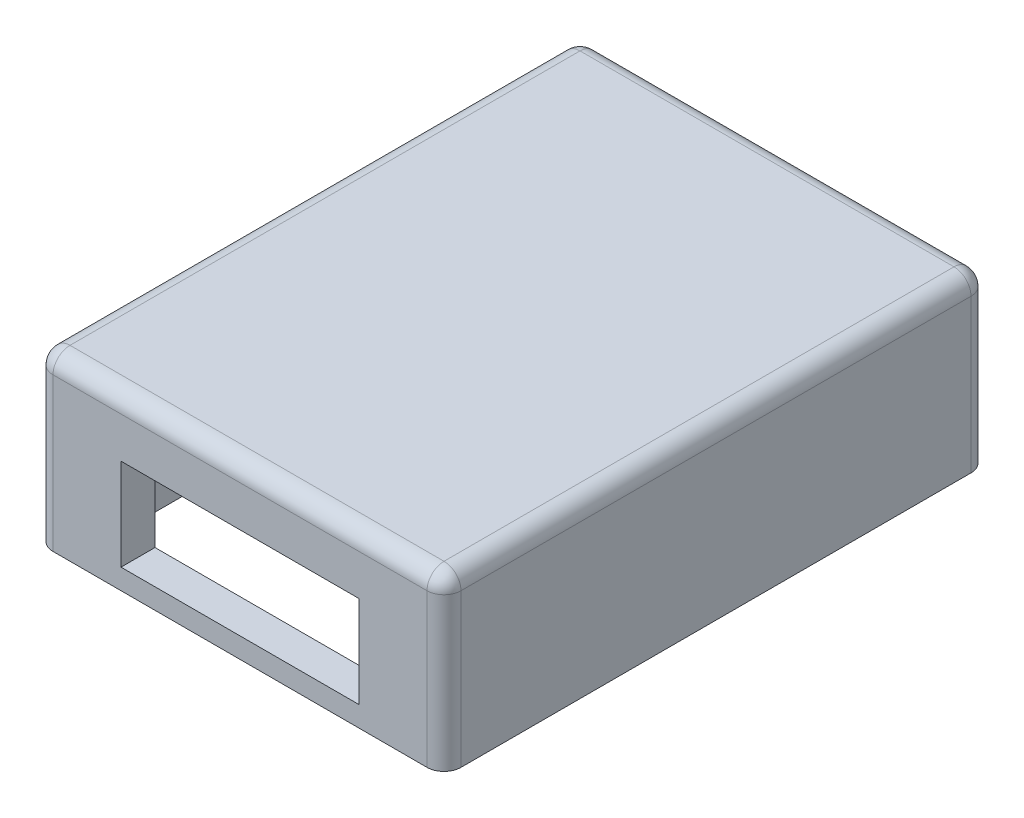
ISO-10303-21;
HEADER;
FILE_DESCRIPTION(('STEP AP214'),'2;1');
FILE_NAME('part.step','',(''),(''),'','','');
FILE_SCHEMA(('AUTOMOTIVE_DESIGN { 1 0 10303 214 1 1 1 1 }'));
ENDSEC;
DATA;
#1=APPLICATION_CONTEXT('core data for automotive mechanical design processes');
#2=APPLICATION_PROTOCOL_DEFINITION('international standard','automotive_design',2000,#1);
#3=PRODUCT_CONTEXT('',#1,'mechanical');
#4=PRODUCT('Part','Part','',(#3));
#5=PRODUCT_RELATED_PRODUCT_CATEGORY('part','',(#4));
#6=PRODUCT_DEFINITION_FORMATION('','',#4);
#7=PRODUCT_DEFINITION_CONTEXT('part definition',#1,'design');
#8=PRODUCT_DEFINITION('design','',#6,#7);
#9=PRODUCT_DEFINITION_SHAPE('','',#8);
#10=(LENGTH_UNIT() NAMED_UNIT(*) SI_UNIT(.MILLI.,.METRE.));
#11=(NAMED_UNIT(*) PLANE_ANGLE_UNIT() SI_UNIT($,.RADIAN.));
#12=(NAMED_UNIT(*) SI_UNIT($,.STERADIAN.) SOLID_ANGLE_UNIT());
#13=UNCERTAINTY_MEASURE_WITH_UNIT(LENGTH_MEASURE(1.E-05),#10,'distance_accuracy_value','');
#14=(GEOMETRIC_REPRESENTATION_CONTEXT(3) GLOBAL_UNCERTAINTY_ASSIGNED_CONTEXT((#13)) GLOBAL_UNIT_ASSIGNED_CONTEXT((#10,
#11,#12)) REPRESENTATION_CONTEXT('',''));
#15=CARTESIAN_POINT('',(0.,0.,0.));
#16=DIRECTION('',(0.,0.,1.));
#17=DIRECTION('',(1.,0.,0.));
#18=AXIS2_PLACEMENT_3D('',#15,#16,#17);
#19=CARTESIAN_POINT('',(0.,0.,160.));
#20=DIRECTION('',(1.,0.,0.));
#21=DIRECTION('',(0.,1.,0.));
#22=AXIS2_PLACEMENT_3D('',#19,#20,#21);
#23=PLANE('',#22);
#24=DIRECTION('',(0.,-1.,0.));
#25=VECTOR('',#24,1.);
#26=CARTESIAN_POINT('',(0.,0.,155.));
#27=LINE('',#26,#25);
#28=CARTESIAN_POINT('',(0.,-50.,155.));
#29=VERTEX_POINT('',#28);
#30=CARTESIAN_POINT('',(0.,-5.,155.));
#31=VERTEX_POINT('',#30);
#32=EDGE_CURVE('E281',#29,#31,#27,.F.);
#33=ORIENTED_EDGE('',*,*,#32,.T.);
#34=DIRECTION('',(0.,0.,-1.));
#35=VECTOR('',#34,1.);
#36=CARTESIAN_POINT('',(0.,-5.,160.));
#37=LINE('',#36,#35);
#38=CARTESIAN_POINT('',(0.,-5.,5.));
#39=VERTEX_POINT('',#38);
#40=EDGE_CURVE('E405',#31,#39,#37,.T.);
#41=ORIENTED_EDGE('',*,*,#40,.T.);
#42=DIRECTION('',(0.,-1.,0.));
#43=VECTOR('',#42,1.);
#44=CARTESIAN_POINT('',(0.,0.,5.));
#45=LINE('',#44,#43);
#46=CARTESIAN_POINT('',(0.,-50.,5.));
#47=VERTEX_POINT('',#46);
#48=EDGE_CURVE('E284',#39,#47,#45,.T.);
#49=ORIENTED_EDGE('',*,*,#48,.T.);
#50=DIRECTION('',(0.,0.,-1.));
#51=VECTOR('',#50,1.);
#52=CARTESIAN_POINT('',(0.,-50.,160.));
#53=LINE('',#52,#51);
#54=EDGE_CURVE('E274',#29,#47,#53,.T.);
#55=ORIENTED_EDGE('',*,*,#54,.F.);
#56=EDGE_LOOP('',(#33,#41,#49,#55));
#57=FACE_BOUND('',#56,.T.);
#58=ADVANCED_FACE('F38',(#57),#23,.F.);
#59=CARTESIAN_POINT('',(0.,-50.,160.));
#60=DIRECTION('',(0.,1.,0.));
#61=DIRECTION('',(0.,0.,1.));
#62=AXIS2_PLACEMENT_3D('',#59,#60,#61);
#63=PLANE('',#62);
#64=CARTESIAN_POINT('',(5.00000000000001,-50.,5.));
#65=DIRECTION('',(0.,-1.,0.));
#66=DIRECTION('',(0.,0.,-1.));
#67=AXIS2_PLACEMENT_3D('',#64,#65,#66);
#68=CIRCLE('',#67,1.5);
#69=CARTESIAN_POINT('',(5.00000000000001,-50.,3.5));
#70=VERTEX_POINT('',#69);
#71=EDGE_CURVE('E225',#70,#70,#68,.T.);
#72=ORIENTED_EDGE('',*,*,#71,.F.);
#73=EDGE_LOOP('',(#72));
#74=FACE_BOUND('',#73,.T.);
#75=CARTESIAN_POINT('',(115.,-50.,5.));
#76=DIRECTION('',(0.,-1.,0.));
#77=DIRECTION('',(0.,0.,-1.));
#78=AXIS2_PLACEMENT_3D('',#75,#76,#77);
#79=CIRCLE('',#78,1.5);
#80=CARTESIAN_POINT('',(115.,-50.,3.50000000000001));
#81=VERTEX_POINT('',#80);
#82=EDGE_CURVE('E238',#81,#81,#79,.T.);
#83=ORIENTED_EDGE('',*,*,#82,.F.);
#84=EDGE_LOOP('',(#83));
#85=FACE_BOUND('',#84,.T.);
#86=CARTESIAN_POINT('',(115.,-50.,155.));
#87=DIRECTION('',(0.,-1.,0.));
#88=DIRECTION('',(0.,0.,-1.));
#89=AXIS2_PLACEMENT_3D('',#86,#87,#88);
#90=CIRCLE('',#89,1.5);
#91=CARTESIAN_POINT('',(115.,-50.,153.5));
#92=VERTEX_POINT('',#91);
#93=EDGE_CURVE('E232',#92,#92,#90,.T.);
#94=ORIENTED_EDGE('',*,*,#93,.F.);
#95=EDGE_LOOP('',(#94));
#96=FACE_BOUND('',#95,.T.);
#97=CARTESIAN_POINT('',(5.00000000000001,-50.,155.));
#98=DIRECTION('',(0.,-1.,0.));
#99=DIRECTION('',(0.,0.,-1.));
#100=AXIS2_PLACEMENT_3D('',#97,#98,#99);
#101=CIRCLE('',#100,1.5);
#102=CARTESIAN_POINT('',(5.00000000000001,-50.,153.5));
#103=VERTEX_POINT('',#102);
#104=EDGE_CURVE('E231',#103,#103,#101,.T.);
#105=ORIENTED_EDGE('',*,*,#104,.F.);
#106=EDGE_LOOP('',(#105));
#107=FACE_BOUND('',#106,.T.);
#108=DIRECTION('',(1.,0.,0.));
#109=VECTOR('',#108,1.);
#110=CARTESIAN_POINT('',(10.,-50.,10.));
#111=LINE('',#110,#109);
#112=CARTESIAN_POINT('',(15.,-50.,10.));
#113=VERTEX_POINT('',#112);
#114=CARTESIAN_POINT('',(105.,-50.,10.));
#115=VERTEX_POINT('',#114);
#116=EDGE_CURVE('E255',#113,#115,#111,.T.);
#117=ORIENTED_EDGE('',*,*,#116,.F.);
#118=CARTESIAN_POINT('',(15.,-50.,15.));
#119=DIRECTION('',(0.,1.,0.));
#120=DIRECTION('',(0.,0.,1.));
#121=AXIS2_PLACEMENT_3D('',#118,#119,#120);
#122=CIRCLE('',#121,5.);
#123=CARTESIAN_POINT('',(10.,-50.,15.));
#124=VERTEX_POINT('',#123);
#125=EDGE_CURVE('E327',#113,#124,#122,.T.);
#126=ORIENTED_EDGE('',*,*,#125,.T.);
#127=DIRECTION('',(0.,0.,-1.));
#128=VECTOR('',#127,1.);
#129=CARTESIAN_POINT('',(10.,-50.,150.));
#130=LINE('',#129,#128);
#131=CARTESIAN_POINT('',(10.,-50.,145.));
#132=VERTEX_POINT('',#131);
#133=EDGE_CURVE('E252',#132,#124,#130,.T.);
#134=ORIENTED_EDGE('',*,*,#133,.F.);
#135=CARTESIAN_POINT('',(15.,-50.,145.));
#136=DIRECTION('',(0.,1.,0.));
#137=DIRECTION('',(0.,0.,1.));
#138=AXIS2_PLACEMENT_3D('',#135,#136,#137);
#139=CIRCLE('',#138,5.);
#140=CARTESIAN_POINT('',(15.,-50.,150.));
#141=VERTEX_POINT('',#140);
#142=EDGE_CURVE('E331',#132,#141,#139,.T.);
#143=ORIENTED_EDGE('',*,*,#142,.T.);
#144=DIRECTION('',(-1.,0.,0.));
#145=VECTOR('',#144,1.);
#146=CARTESIAN_POINT('',(10.,-50.,150.));
#147=LINE('',#146,#145);
#148=CARTESIAN_POINT('',(105.,-50.,150.));
#149=VERTEX_POINT('',#148);
#150=EDGE_CURVE('E262',#149,#141,#147,.T.);
#151=ORIENTED_EDGE('',*,*,#150,.F.);
#152=CARTESIAN_POINT('',(105.,-50.,145.));
#153=DIRECTION('',(0.,1.,0.));
#154=DIRECTION('',(0.,0.,1.));
#155=AXIS2_PLACEMENT_3D('',#152,#153,#154);
#156=CIRCLE('',#155,5.);
#157=CARTESIAN_POINT('',(110.,-50.,145.));
#158=VERTEX_POINT('',#157);
#159=EDGE_CURVE('E329',#149,#158,#156,.T.);
#160=ORIENTED_EDGE('',*,*,#159,.T.);
#161=DIRECTION('',(0.,0.,1.));
#162=VECTOR('',#161,1.);
#163=CARTESIAN_POINT('',(110.,-50.,150.));
#164=LINE('',#163,#162);
#165=CARTESIAN_POINT('',(110.,-50.,15.));
#166=VERTEX_POINT('',#165);
#167=EDGE_CURVE('E259',#166,#158,#164,.T.);
#168=ORIENTED_EDGE('',*,*,#167,.F.);
#169=CARTESIAN_POINT('',(105.,-50.,15.));
#170=DIRECTION('',(0.,1.,0.));
#171=DIRECTION('',(0.,0.,1.));
#172=AXIS2_PLACEMENT_3D('',#169,#170,#171);
#173=CIRCLE('',#172,5.);
#174=EDGE_CURVE('E325',#166,#115,#173,.T.);
#175=ORIENTED_EDGE('',*,*,#174,.T.);
#176=EDGE_LOOP('',(#117,#126,#134,#143,#151,#160,#168,#175));
#177=FACE_BOUND('',#176,.T.);
#178=ORIENTED_EDGE('',*,*,#54,.T.);
#179=CARTESIAN_POINT('',(5.00000000000001,-50.,5.));
#180=DIRECTION('',(0.,1.,0.));
#181=DIRECTION('',(0.,0.,1.));
#182=AXIS2_PLACEMENT_3D('',#179,#180,#181);
#183=CIRCLE('',#182,5.);
#184=CARTESIAN_POINT('',(5.,-50.,0.));
#185=VERTEX_POINT('',#184);
#186=EDGE_CURVE('E290',#47,#185,#183,.F.);
#187=ORIENTED_EDGE('',*,*,#186,.T.);
#188=DIRECTION('',(1.,0.,0.));
#189=VECTOR('',#188,1.);
#190=CARTESIAN_POINT('',(0.,-50.,0.));
#191=LINE('',#190,#189);
#192=CARTESIAN_POINT('',(115.,-50.,0.));
#193=VERTEX_POINT('',#192);
#194=EDGE_CURVE('E265',#185,#193,#191,.T.);
#195=ORIENTED_EDGE('',*,*,#194,.T.);
#196=CARTESIAN_POINT('',(115.,-50.,5.));
#197=DIRECTION('',(0.,1.,0.));
#198=DIRECTION('',(0.,0.,1.));
#199=AXIS2_PLACEMENT_3D('',#196,#197,#198);
#200=CIRCLE('',#199,5.);
#201=CARTESIAN_POINT('',(120.,-50.,5.));
#202=VERTEX_POINT('',#201);
#203=EDGE_CURVE('E288',#193,#202,#200,.F.);
#204=ORIENTED_EDGE('',*,*,#203,.T.);
#205=DIRECTION('',(0.,0.,-1.));
#206=VECTOR('',#205,1.);
#207=CARTESIAN_POINT('',(120.,-50.,160.));
#208=LINE('',#207,#206);
#209=CARTESIAN_POINT('',(120.,-50.,155.));
#210=VERTEX_POINT('',#209);
#211=EDGE_CURVE('E269',#210,#202,#208,.T.);
#212=ORIENTED_EDGE('',*,*,#211,.F.);
#213=CARTESIAN_POINT('',(115.,-50.,155.));
#214=DIRECTION('',(0.,1.,0.));
#215=DIRECTION('',(0.,0.,1.));
#216=AXIS2_PLACEMENT_3D('',#213,#214,#215);
#217=CIRCLE('',#216,5.);
#218=CARTESIAN_POINT('',(115.,-50.,160.));
#219=VERTEX_POINT('',#218);
#220=EDGE_CURVE('E286',#210,#219,#217,.F.);
#221=ORIENTED_EDGE('',*,*,#220,.T.);
#222=DIRECTION('',(1.,0.,0.));
#223=VECTOR('',#222,1.);
#224=CARTESIAN_POINT('',(0.,-50.,160.));
#225=LINE('',#224,#223);
#226=CARTESIAN_POINT('',(5.,-50.,160.));
#227=VERTEX_POINT('',#226);
#228=EDGE_CURVE('E266',#227,#219,#225,.T.);
#229=ORIENTED_EDGE('',*,*,#228,.F.);
#230=CARTESIAN_POINT('',(5.00000000000001,-50.,155.));
#231=DIRECTION('',(0.,1.,0.));
#232=DIRECTION('',(0.,0.,1.));
#233=AXIS2_PLACEMENT_3D('',#230,#231,#232);
#234=CIRCLE('',#233,5.);
#235=EDGE_CURVE('E279',#227,#29,#234,.F.);
#236=ORIENTED_EDGE('',*,*,#235,.T.);
#237=EDGE_LOOP('',(#178,#187,#195,#204,#212,#221,#229,#236));
#238=FACE_BOUND('',#237,.T.);
#239=ADVANCED_FACE('F451',(#74,#85,#96,#107,#177,#238),#63,.F.);
#240=CARTESIAN_POINT('',(120.,0.,160.));
#241=DIRECTION('',(-1.,0.,0.));
#242=DIRECTION('',(0.,-1.,0.));
#243=AXIS2_PLACEMENT_3D('',#240,#241,#242);
#244=PLANE('',#243);
#245=DIRECTION('',(0.,1.,0.));
#246=VECTOR('',#245,1.);
#247=CARTESIAN_POINT('',(120.,0.,5.));
#248=LINE('',#247,#246);
#249=CARTESIAN_POINT('',(120.,-5.,5.));
#250=VERTEX_POINT('',#249);
#251=EDGE_CURVE('E299',#202,#250,#248,.T.);
#252=ORIENTED_EDGE('',*,*,#251,.T.);
#253=DIRECTION('',(0.,0.,-1.));
#254=VECTOR('',#253,1.);
#255=CARTESIAN_POINT('',(120.,-5.,160.));
#256=LINE('',#255,#254);
#257=CARTESIAN_POINT('',(120.,-5.,155.));
#258=VERTEX_POINT('',#257);
#259=EDGE_CURVE('E397',#250,#258,#256,.F.);
#260=ORIENTED_EDGE('',*,*,#259,.T.);
#261=DIRECTION('',(0.,1.,0.));
#262=VECTOR('',#261,1.);
#263=CARTESIAN_POINT('',(120.,-50.,155.));
#264=LINE('',#263,#262);
#265=EDGE_CURVE('E297',#258,#210,#264,.F.);
#266=ORIENTED_EDGE('',*,*,#265,.T.);
#267=ORIENTED_EDGE('',*,*,#211,.T.);
#268=EDGE_LOOP('',(#252,#260,#266,#267));
#269=FACE_BOUND('',#268,.T.);
#270=ADVANCED_FACE('F457',(#269),#244,.F.);
#271=CARTESIAN_POINT('',(0.,0.,160.));
#272=DIRECTION('',(0.,-1.,0.));
#273=DIRECTION('',(0.,0.,-1.));
#274=AXIS2_PLACEMENT_3D('',#271,#272,#273);
#275=PLANE('',#274);
#276=DIRECTION('',(0.,0.,-1.));
#277=VECTOR('',#276,1.);
#278=CARTESIAN_POINT('',(5.,0.,160.));
#279=LINE('',#278,#277);
#280=CARTESIAN_POINT('',(5.,0.,5.));
#281=VERTEX_POINT('',#280);
#282=CARTESIAN_POINT('',(5.,0.,155.));
#283=VERTEX_POINT('',#282);
#284=EDGE_CURVE('E386',#281,#283,#279,.F.);
#285=ORIENTED_EDGE('',*,*,#284,.T.);
#286=DIRECTION('',(-1.,0.,0.));
#287=VECTOR('',#286,1.);
#288=CARTESIAN_POINT('',(115.,0.,155.));
#289=LINE('',#288,#287);
#290=CARTESIAN_POINT('',(115.,0.,155.));
#291=VERTEX_POINT('',#290);
#292=EDGE_CURVE('E392',#283,#291,#289,.F.);
#293=ORIENTED_EDGE('',*,*,#292,.T.);
#294=DIRECTION('',(0.,0.,-1.));
#295=VECTOR('',#294,1.);
#296=CARTESIAN_POINT('',(115.,0.,160.));
#297=LINE('',#296,#295);
#298=CARTESIAN_POINT('',(115.,0.,5.));
#299=VERTEX_POINT('',#298);
#300=EDGE_CURVE('E390',#291,#299,#297,.T.);
#301=ORIENTED_EDGE('',*,*,#300,.T.);
#302=DIRECTION('',(-1.,0.,0.));
#303=VECTOR('',#302,1.);
#304=CARTESIAN_POINT('',(0.,0.,5.));
#305=LINE('',#304,#303);
#306=EDGE_CURVE('E388',#299,#281,#305,.T.);
#307=ORIENTED_EDGE('',*,*,#306,.T.);
#308=EDGE_LOOP('',(#285,#293,#301,#307));
#309=FACE_BOUND('',#308,.T.);
#310=ADVANCED_FACE('F600',(#309),#275,.F.);
#311=CARTESIAN_POINT('',(0.,0.,160.));
#312=DIRECTION('',(0.,0.,1.));
#313=DIRECTION('',(1.,0.,0.));
#314=AXIS2_PLACEMENT_3D('',#311,#312,#313);
#315=PLANE('',#314);
#316=DIRECTION('',(0.,-1.,0.));
#317=VECTOR('',#316,1.);
#318=CARTESIAN_POINT('',(25.,-17.,160.));
#319=LINE('',#318,#317);
#320=CARTESIAN_POINT('',(25.,-17.,160.));
#321=VERTEX_POINT('',#320);
#322=CARTESIAN_POINT('',(25.,-44.,160.));
#323=VERTEX_POINT('',#322);
#324=EDGE_CURVE('E53',#321,#323,#319,.T.);
#325=ORIENTED_EDGE('',*,*,#324,.F.);
#326=DIRECTION('',(-1.,0.,0.));
#327=VECTOR('',#326,1.);
#328=CARTESIAN_POINT('',(25.,-17.,160.));
#329=LINE('',#328,#327);
#330=CARTESIAN_POINT('',(95.,-17.,160.));
#331=VERTEX_POINT('',#330);
#332=EDGE_CURVE('E218',#331,#321,#329,.T.);
#333=ORIENTED_EDGE('',*,*,#332,.F.);
#334=DIRECTION('',(0.,1.,0.));
#335=VECTOR('',#334,1.);
#336=CARTESIAN_POINT('',(95.,-17.,160.));
#337=LINE('',#336,#335);
#338=CARTESIAN_POINT('',(95.,-44.,160.));
#339=VERTEX_POINT('',#338);
#340=EDGE_CURVE('E202',#339,#331,#337,.T.);
#341=ORIENTED_EDGE('',*,*,#340,.F.);
#342=DIRECTION('',(1.,0.,0.));
#343=VECTOR('',#342,1.);
#344=CARTESIAN_POINT('',(25.,-44.,160.));
#345=LINE('',#344,#343);
#346=EDGE_CURVE('E211',#323,#339,#345,.T.);
#347=ORIENTED_EDGE('',*,*,#346,.F.);
#348=EDGE_LOOP('',(#325,#333,#341,#347));
#349=FACE_BOUND('',#348,.T.);
#350=DIRECTION('',(0.,1.,0.));
#351=VECTOR('',#350,1.);
#352=CARTESIAN_POINT('',(115.,0.,160.));
#353=LINE('',#352,#351);
#354=CARTESIAN_POINT('',(115.,-5.,160.));
#355=VERTEX_POINT('',#354);
#356=EDGE_CURVE('E302',#219,#355,#353,.T.);
#357=ORIENTED_EDGE('',*,*,#356,.T.);
#358=DIRECTION('',(-1.,0.,0.));
#359=VECTOR('',#358,1.);
#360=CARTESIAN_POINT('',(5.,-5.,160.));
#361=LINE('',#360,#359);
#362=CARTESIAN_POINT('',(5.,-5.,160.));
#363=VERTEX_POINT('',#362);
#364=EDGE_CURVE('E384',#355,#363,#361,.T.);
#365=ORIENTED_EDGE('',*,*,#364,.T.);
#366=DIRECTION('',(0.,-1.,0.));
#367=VECTOR('',#366,1.);
#368=CARTESIAN_POINT('',(5.00000000000001,-50.,160.));
#369=LINE('',#368,#367);
#370=EDGE_CURVE('E277',#363,#227,#369,.T.);
#371=ORIENTED_EDGE('',*,*,#370,.T.);
#372=ORIENTED_EDGE('',*,*,#228,.T.);
#373=EDGE_LOOP('',(#357,#365,#371,#372));
#374=FACE_BOUND('',#373,.T.);
#375=ADVANCED_FACE('F215',(#349,#374),#315,.T.);
#376=CARTESIAN_POINT('',(0.,0.,0.));
#377=DIRECTION('',(0.,0.,1.));
#378=DIRECTION('',(1.,0.,0.));
#379=AXIS2_PLACEMENT_3D('',#376,#377,#378);
#380=PLANE('',#379);
#381=DIRECTION('',(0.,-1.,0.));
#382=VECTOR('',#381,1.);
#383=CARTESIAN_POINT('',(5.,0.,0.));
#384=LINE('',#383,#382);
#385=CARTESIAN_POINT('',(5.,-5.,0.));
#386=VERTEX_POINT('',#385);
#387=EDGE_CURVE('E294',#185,#386,#384,.F.);
#388=ORIENTED_EDGE('',*,*,#387,.T.);
#389=DIRECTION('',(-1.,0.,0.));
#390=VECTOR('',#389,1.);
#391=CARTESIAN_POINT('',(0.,-5.,0.));
#392=LINE('',#391,#390);
#393=CARTESIAN_POINT('',(115.,-5.,0.));
#394=VERTEX_POINT('',#393);
#395=EDGE_CURVE('E401',#386,#394,#392,.F.);
#396=ORIENTED_EDGE('',*,*,#395,.T.);
#397=DIRECTION('',(0.,1.,0.));
#398=VECTOR('',#397,1.);
#399=CARTESIAN_POINT('',(115.,0.,0.));
#400=LINE('',#399,#398);
#401=EDGE_CURVE('E292',#394,#193,#400,.F.);
#402=ORIENTED_EDGE('',*,*,#401,.T.);
#403=ORIENTED_EDGE('',*,*,#194,.F.);
#404=EDGE_LOOP('',(#388,#396,#402,#403));
#405=FACE_BOUND('',#404,.T.);
#406=ADVANCED_FACE('F466',(#405),#380,.F.);
#407=CARTESIAN_POINT('',(5.,0.,155.));
#408=DIRECTION('',(0.,1.,0.));
#409=DIRECTION('',(-1.,0.,0.));
#410=AXIS2_PLACEMENT_3D('',#407,#408,#409);
#411=CYLINDRICAL_SURFACE('',#410,5.);
#412=ORIENTED_EDGE('',*,*,#370,.F.);
#413=CARTESIAN_POINT('',(5.,-5.,155.));
#414=DIRECTION('',(0.,1.,0.));
#415=DIRECTION('',(-1.,0.,0.));
#416=AXIS2_PLACEMENT_3D('',#413,#414,#415);
#417=CIRCLE('',#416,5.);
#418=EDGE_CURVE('E359',#363,#31,#417,.F.);
#419=ORIENTED_EDGE('',*,*,#418,.T.);
#420=ORIENTED_EDGE('',*,*,#32,.F.);
#421=ORIENTED_EDGE('',*,*,#235,.F.);
#422=EDGE_LOOP('',(#412,#419,#420,#421));
#423=FACE_BOUND('',#422,.T.);
#424=ADVANCED_FACE('F462',(#423),#411,.T.);
#425=CARTESIAN_POINT('',(5.,0.,5.));
#426=DIRECTION('',(0.,-1.,0.));
#427=DIRECTION('',(1.,0.,0.));
#428=AXIS2_PLACEMENT_3D('',#425,#426,#427);
#429=CYLINDRICAL_SURFACE('',#428,5.);
#430=ORIENTED_EDGE('',*,*,#48,.F.);
#431=CARTESIAN_POINT('',(5.,-5.,5.));
#432=DIRECTION('',(0.,-1.,0.));
#433=DIRECTION('',(1.,0.,0.));
#434=AXIS2_PLACEMENT_3D('',#431,#432,#433);
#435=CIRCLE('',#434,5.);
#436=EDGE_CURVE('E403',#39,#386,#435,.T.);
#437=ORIENTED_EDGE('',*,*,#436,.T.);
#438=ORIENTED_EDGE('',*,*,#387,.F.);
#439=ORIENTED_EDGE('',*,*,#186,.F.);
#440=EDGE_LOOP('',(#430,#437,#438,#439));
#441=FACE_BOUND('',#440,.T.);
#442=ADVANCED_FACE('F465',(#441),#429,.T.);
#443=CARTESIAN_POINT('',(115.,0.,5.));
#444=DIRECTION('',(0.,1.,0.));
#445=DIRECTION('',(-1.,0.,0.));
#446=AXIS2_PLACEMENT_3D('',#443,#444,#445);
#447=CYLINDRICAL_SURFACE('',#446,5.);
#448=ORIENTED_EDGE('',*,*,#401,.F.);
#449=CARTESIAN_POINT('',(115.,-5.,5.));
#450=DIRECTION('',(0.,1.,0.));
#451=DIRECTION('',(-1.,0.,0.));
#452=AXIS2_PLACEMENT_3D('',#449,#450,#451);
#453=CIRCLE('',#452,5.);
#454=EDGE_CURVE('E399',#394,#250,#453,.F.);
#455=ORIENTED_EDGE('',*,*,#454,.T.);
#456=ORIENTED_EDGE('',*,*,#251,.F.);
#457=ORIENTED_EDGE('',*,*,#203,.F.);
#458=EDGE_LOOP('',(#448,#455,#456,#457));
#459=FACE_BOUND('',#458,.T.);
#460=ADVANCED_FACE('F470',(#459),#447,.T.);
#461=CARTESIAN_POINT('',(115.,0.,155.));
#462=DIRECTION('',(0.,-1.,0.));
#463=DIRECTION('',(1.,0.,0.));
#464=AXIS2_PLACEMENT_3D('',#461,#462,#463);
#465=CYLINDRICAL_SURFACE('',#464,5.);
#466=ORIENTED_EDGE('',*,*,#265,.F.);
#467=CARTESIAN_POINT('',(115.,-5.,155.));
#468=DIRECTION('',(0.,-1.,0.));
#469=DIRECTION('',(1.,0.,0.));
#470=AXIS2_PLACEMENT_3D('',#467,#468,#469);
#471=CIRCLE('',#470,5.);
#472=EDGE_CURVE('E395',#258,#355,#471,.T.);
#473=ORIENTED_EDGE('',*,*,#472,.T.);
#474=ORIENTED_EDGE('',*,*,#356,.F.);
#475=ORIENTED_EDGE('',*,*,#220,.F.);
#476=EDGE_LOOP('',(#466,#473,#474,#475));
#477=FACE_BOUND('',#476,.T.);
#478=ADVANCED_FACE('F474',(#477),#465,.T.);
#479=CARTESIAN_POINT('',(10.,-5.,150.));
#480=DIRECTION('',(-1.,0.,0.));
#481=DIRECTION('',(0.,0.,1.));
#482=AXIS2_PLACEMENT_3D('',#479,#480,#481);
#483=PLANE('',#482);
#484=DIRECTION('',(0.,-1.,0.));
#485=VECTOR('',#484,1.);
#486=CARTESIAN_POINT('',(10.,-5.,15.));
#487=LINE('',#486,#485);
#488=CARTESIAN_POINT('',(10.,-10.,15.));
#489=VERTEX_POINT('',#488);
#490=EDGE_CURVE('E317',#124,#489,#487,.F.);
#491=ORIENTED_EDGE('',*,*,#490,.T.);
#492=DIRECTION('',(0.,0.,-1.));
#493=VECTOR('',#492,1.);
#494=CARTESIAN_POINT('',(10.,-10.,150.));
#495=LINE('',#494,#493);
#496=CARTESIAN_POINT('',(10.,-10.,145.));
#497=VERTEX_POINT('',#496);
#498=EDGE_CURVE('E345',#489,#497,#495,.F.);
#499=ORIENTED_EDGE('',*,*,#498,.T.);
#500=DIRECTION('',(0.,-1.,0.));
#501=VECTOR('',#500,1.);
#502=CARTESIAN_POINT('',(10.,-50.,145.));
#503=LINE('',#502,#501);
#504=EDGE_CURVE('E315',#497,#132,#503,.T.);
#505=ORIENTED_EDGE('',*,*,#504,.T.);
#506=ORIENTED_EDGE('',*,*,#133,.T.);
#507=EDGE_LOOP('',(#491,#499,#505,#506));
#508=FACE_BOUND('',#507,.T.);
#509=ADVANCED_FACE('F478',(#508),#483,.F.);
#510=CARTESIAN_POINT('',(10.,-5.,150.));
#511=DIRECTION('',(0.,0.,1.));
#512=DIRECTION('',(1.,0.,0.));
#513=AXIS2_PLACEMENT_3D('',#510,#511,#512);
#514=PLANE('',#513);
#515=DIRECTION('',(-1.,0.,0.));
#516=VECTOR('',#515,1.);
#517=CARTESIAN_POINT('',(10.,-17.,150.));
#518=LINE('',#517,#516);
#519=CARTESIAN_POINT('',(95.,-17.,150.));
#520=VERTEX_POINT('',#519);
#521=CARTESIAN_POINT('',(25.,-17.,150.));
#522=VERTEX_POINT('',#521);
#523=EDGE_CURVE('E46',#520,#522,#518,.T.);
#524=ORIENTED_EDGE('',*,*,#523,.T.);
#525=DIRECTION('',(0.,-1.,0.));
#526=VECTOR('',#525,1.);
#527=CARTESIAN_POINT('',(25.,-5.,150.));
#528=LINE('',#527,#526);
#529=CARTESIAN_POINT('',(25.,-44.,150.));
#530=VERTEX_POINT('',#529);
#531=EDGE_CURVE('E11',#522,#530,#528,.T.);
#532=ORIENTED_EDGE('',*,*,#531,.T.);
#533=DIRECTION('',(1.,0.,0.));
#534=VECTOR('',#533,1.);
#535=CARTESIAN_POINT('',(10.,-44.,150.));
#536=LINE('',#535,#534);
#537=CARTESIAN_POINT('',(95.,-44.,150.));
#538=VERTEX_POINT('',#537);
#539=EDGE_CURVE('E407',#530,#538,#536,.T.);
#540=ORIENTED_EDGE('',*,*,#539,.T.);
#541=DIRECTION('',(0.,1.,0.));
#542=VECTOR('',#541,1.);
#543=CARTESIAN_POINT('',(95.,-5.00000000000005,150.));
#544=LINE('',#543,#542);
#545=EDGE_CURVE('E205',#538,#520,#544,.T.);
#546=ORIENTED_EDGE('',*,*,#545,.T.);
#547=EDGE_LOOP('',(#524,#532,#540,#546));
#548=FACE_BOUND('',#547,.T.);
#549=DIRECTION('',(0.,-1.,0.));
#550=VECTOR('',#549,1.);
#551=CARTESIAN_POINT('',(15.,-5.,150.));
#552=LINE('',#551,#550);
#553=CARTESIAN_POINT('',(15.,-10.,150.));
#554=VERTEX_POINT('',#553);
#555=EDGE_CURVE('E320',#141,#554,#552,.F.);
#556=ORIENTED_EDGE('',*,*,#555,.T.);
#557=DIRECTION('',(-1.,0.,0.));
#558=VECTOR('',#557,1.);
#559=CARTESIAN_POINT('',(10.,-10.,150.));
#560=LINE('',#559,#558);
#561=CARTESIAN_POINT('',(105.,-10.,150.));
#562=VERTEX_POINT('',#561);
#563=EDGE_CURVE('E349',#554,#562,#560,.F.);
#564=ORIENTED_EDGE('',*,*,#563,.T.);
#565=DIRECTION('',(0.,-1.,0.));
#566=VECTOR('',#565,1.);
#567=CARTESIAN_POINT('',(105.,-50.,150.));
#568=LINE('',#567,#566);
#569=EDGE_CURVE('E323',#562,#149,#568,.T.);
#570=ORIENTED_EDGE('',*,*,#569,.T.);
#571=ORIENTED_EDGE('',*,*,#150,.T.);
#572=EDGE_LOOP('',(#556,#564,#570,#571));
#573=FACE_BOUND('',#572,.T.);
#574=ADVANCED_FACE('F431',(#548,#573),#514,.F.);
#575=CARTESIAN_POINT('',(110.,-5.,150.));
#576=DIRECTION('',(1.,0.,0.));
#577=DIRECTION('',(0.,0.,-1.));
#578=AXIS2_PLACEMENT_3D('',#575,#576,#577);
#579=PLANE('',#578);
#580=DIRECTION('',(0.,-1.,0.));
#581=VECTOR('',#580,1.);
#582=CARTESIAN_POINT('',(110.,-5.,145.));
#583=LINE('',#582,#581);
#584=CARTESIAN_POINT('',(110.,-10.,145.));
#585=VERTEX_POINT('',#584);
#586=EDGE_CURVE('E305',#158,#585,#583,.F.);
#587=ORIENTED_EDGE('',*,*,#586,.T.);
#588=DIRECTION('',(0.,0.,1.));
#589=VECTOR('',#588,1.);
#590=CARTESIAN_POINT('',(110.,-10.,150.));
#591=LINE('',#590,#589);
#592=CARTESIAN_POINT('',(110.,-10.,15.));
#593=VERTEX_POINT('',#592);
#594=EDGE_CURVE('E353',#585,#593,#591,.F.);
#595=ORIENTED_EDGE('',*,*,#594,.T.);
#596=DIRECTION('',(0.,-1.,0.));
#597=VECTOR('',#596,1.);
#598=CARTESIAN_POINT('',(110.,-50.,15.));
#599=LINE('',#598,#597);
#600=EDGE_CURVE('E308',#593,#166,#599,.T.);
#601=ORIENTED_EDGE('',*,*,#600,.T.);
#602=ORIENTED_EDGE('',*,*,#167,.T.);
#603=EDGE_LOOP('',(#587,#595,#601,#602));
#604=FACE_BOUND('',#603,.T.);
#605=ADVANCED_FACE('F617',(#604),#579,.F.);
#606=CARTESIAN_POINT('',(10.,-5.,10.));
#607=DIRECTION('',(0.,0.,-1.));
#608=DIRECTION('',(-1.,0.,0.));
#609=AXIS2_PLACEMENT_3D('',#606,#607,#608);
#610=PLANE('',#609);
#611=DIRECTION('',(0.,-1.,0.));
#612=VECTOR('',#611,1.);
#613=CARTESIAN_POINT('',(105.,-5.,10.));
#614=LINE('',#613,#612);
#615=CARTESIAN_POINT('',(105.,-10.,10.));
#616=VERTEX_POINT('',#615);
#617=EDGE_CURVE('E312',#115,#616,#614,.F.);
#618=ORIENTED_EDGE('',*,*,#617,.T.);
#619=DIRECTION('',(1.,0.,0.));
#620=VECTOR('',#619,1.);
#621=CARTESIAN_POINT('',(10.,-10.,10.));
#622=LINE('',#621,#620);
#623=CARTESIAN_POINT('',(15.,-10.,10.));
#624=VERTEX_POINT('',#623);
#625=EDGE_CURVE('E357',#616,#624,#622,.F.);
#626=ORIENTED_EDGE('',*,*,#625,.T.);
#627=DIRECTION('',(0.,-1.,0.));
#628=VECTOR('',#627,1.);
#629=CARTESIAN_POINT('',(15.,-50.,10.));
#630=LINE('',#629,#628);
#631=EDGE_CURVE('E310',#624,#113,#630,.T.);
#632=ORIENTED_EDGE('',*,*,#631,.T.);
#633=ORIENTED_EDGE('',*,*,#116,.T.);
#634=EDGE_LOOP('',(#618,#626,#632,#633));
#635=FACE_BOUND('',#634,.T.);
#636=ADVANCED_FACE('F614',(#635),#610,.F.);
#637=CARTESIAN_POINT('',(0.,-5.,0.));
#638=DIRECTION('',(0.,-1.,0.));
#639=DIRECTION('',(0.,0.,-1.));
#640=AXIS2_PLACEMENT_3D('',#637,#638,#639);
#641=PLANE('',#640);
#642=DIRECTION('',(-1.,0.,0.));
#643=VECTOR('',#642,1.);
#644=CARTESIAN_POINT('',(0.,-5.,145.));
#645=LINE('',#644,#643);
#646=CARTESIAN_POINT('',(105.,-5.,145.));
#647=VERTEX_POINT('',#646);
#648=CARTESIAN_POINT('',(15.,-5.,145.));
#649=VERTEX_POINT('',#648);
#650=EDGE_CURVE('E340',#647,#649,#645,.T.);
#651=ORIENTED_EDGE('',*,*,#650,.T.);
#652=DIRECTION('',(0.,0.,-1.));
#653=VECTOR('',#652,1.);
#654=CARTESIAN_POINT('',(15.,-5.,0.));
#655=LINE('',#654,#653);
#656=CARTESIAN_POINT('',(15.,-5.,15.));
#657=VERTEX_POINT('',#656);
#658=EDGE_CURVE('E342',#649,#657,#655,.T.);
#659=ORIENTED_EDGE('',*,*,#658,.T.);
#660=DIRECTION('',(1.,0.,0.));
#661=VECTOR('',#660,1.);
#662=CARTESIAN_POINT('',(0.,-5.,15.));
#663=LINE('',#662,#661);
#664=CARTESIAN_POINT('',(105.,-5.,15.));
#665=VERTEX_POINT('',#664);
#666=EDGE_CURVE('E336',#657,#665,#663,.T.);
#667=ORIENTED_EDGE('',*,*,#666,.T.);
#668=DIRECTION('',(0.,0.,1.));
#669=VECTOR('',#668,1.);
#670=CARTESIAN_POINT('',(105.,-5.,0.));
#671=LINE('',#670,#669);
#672=EDGE_CURVE('E338',#665,#647,#671,.T.);
#673=ORIENTED_EDGE('',*,*,#672,.T.);
#674=EDGE_LOOP('',(#651,#659,#667,#673));
#675=FACE_BOUND('',#674,.T.);
#676=ADVANCED_FACE('F484',(#675),#641,.T.);
#677=CARTESIAN_POINT('',(105.,-5.,15.));
#678=DIRECTION('',(0.,1.,0.));
#679=DIRECTION('',(0.,0.,1.));
#680=AXIS2_PLACEMENT_3D('',#677,#678,#679);
#681=CYLINDRICAL_SURFACE('',#680,5.);
#682=ORIENTED_EDGE('',*,*,#600,.F.);
#683=CARTESIAN_POINT('',(105.,-10.,15.));
#684=DIRECTION('',(0.,1.,0.));
#685=DIRECTION('',(0.,0.,1.));
#686=AXIS2_PLACEMENT_3D('',#683,#684,#685);
#687=CIRCLE('',#686,5.);
#688=EDGE_CURVE('E355',#593,#616,#687,.T.);
#689=ORIENTED_EDGE('',*,*,#688,.T.);
#690=ORIENTED_EDGE('',*,*,#617,.F.);
#691=ORIENTED_EDGE('',*,*,#174,.F.);
#692=EDGE_LOOP('',(#682,#689,#690,#691));
#693=FACE_BOUND('',#692,.T.);
#694=ADVANCED_FACE('F480',(#693),#681,.F.);
#695=CARTESIAN_POINT('',(15.,-5.,15.));
#696=DIRECTION('',(0.,1.,0.));
#697=DIRECTION('',(0.,0.,1.));
#698=AXIS2_PLACEMENT_3D('',#695,#696,#697);
#699=CYLINDRICAL_SURFACE('',#698,5.);
#700=ORIENTED_EDGE('',*,*,#631,.F.);
#701=CARTESIAN_POINT('',(15.,-10.,15.));
#702=DIRECTION('',(0.,1.,0.));
#703=DIRECTION('',(0.,0.,1.));
#704=AXIS2_PLACEMENT_3D('',#701,#702,#703);
#705=CIRCLE('',#704,5.);
#706=EDGE_CURVE('E333',#624,#489,#705,.T.);
#707=ORIENTED_EDGE('',*,*,#706,.T.);
#708=ORIENTED_EDGE('',*,*,#490,.F.);
#709=ORIENTED_EDGE('',*,*,#125,.F.);
#710=EDGE_LOOP('',(#700,#707,#708,#709));
#711=FACE_BOUND('',#710,.T.);
#712=ADVANCED_FACE('F483',(#711),#699,.F.);
#713=CARTESIAN_POINT('',(105.,-5.,145.));
#714=DIRECTION('',(0.,1.,0.));
#715=DIRECTION('',(0.,0.,1.));
#716=AXIS2_PLACEMENT_3D('',#713,#714,#715);
#717=CYLINDRICAL_SURFACE('',#716,5.);
#718=ORIENTED_EDGE('',*,*,#569,.F.);
#719=CARTESIAN_POINT('',(105.,-10.,145.));
#720=DIRECTION('',(0.,1.,0.));
#721=DIRECTION('',(0.,0.,1.));
#722=AXIS2_PLACEMENT_3D('',#719,#720,#721);
#723=CIRCLE('',#722,5.);
#724=EDGE_CURVE('E351',#562,#585,#723,.T.);
#725=ORIENTED_EDGE('',*,*,#724,.T.);
#726=ORIENTED_EDGE('',*,*,#586,.F.);
#727=ORIENTED_EDGE('',*,*,#159,.F.);
#728=EDGE_LOOP('',(#718,#725,#726,#727));
#729=FACE_BOUND('',#728,.T.);
#730=ADVANCED_FACE('F488',(#729),#717,.F.);
#731=CARTESIAN_POINT('',(15.,-5.,145.));
#732=DIRECTION('',(0.,1.,0.));
#733=DIRECTION('',(0.,0.,1.));
#734=AXIS2_PLACEMENT_3D('',#731,#732,#733);
#735=CYLINDRICAL_SURFACE('',#734,5.);
#736=ORIENTED_EDGE('',*,*,#504,.F.);
#737=CARTESIAN_POINT('',(15.,-10.,145.));
#738=DIRECTION('',(0.,1.,0.));
#739=DIRECTION('',(0.,0.,1.));
#740=AXIS2_PLACEMENT_3D('',#737,#738,#739);
#741=CIRCLE('',#740,5.);
#742=EDGE_CURVE('E347',#497,#554,#741,.T.);
#743=ORIENTED_EDGE('',*,*,#742,.T.);
#744=ORIENTED_EDGE('',*,*,#555,.F.);
#745=ORIENTED_EDGE('',*,*,#142,.F.);
#746=EDGE_LOOP('',(#736,#743,#744,#745));
#747=FACE_BOUND('',#746,.T.);
#748=ADVANCED_FACE('F492',(#747),#735,.F.);
#749=CARTESIAN_POINT('',(105.,-10.,145.));
#750=DIRECTION('',(0.,-1.,0.));
#751=DIRECTION('',(0.,0.,-1.));
#752=AXIS2_PLACEMENT_3D('',#749,#750,#751);
#753=SPHERICAL_SURFACE('',#752,5.);
#754=CARTESIAN_POINT('',(105.,-10.,145.));
#755=DIRECTION('',(0.,0.,1.));
#756=DIRECTION('',(1.,0.,0.));
#757=AXIS2_PLACEMENT_3D('',#754,#755,#756);
#758=CIRCLE('',#757,5.);
#759=EDGE_CURVE('E377',#585,#647,#758,.T.);
#760=ORIENTED_EDGE('',*,*,#759,.F.);
#761=ORIENTED_EDGE('',*,*,#724,.F.);
#762=CARTESIAN_POINT('',(105.,-10.,145.));
#763=DIRECTION('',(1.,0.,0.));
#764=DIRECTION('',(0.,0.,-1.));
#765=AXIS2_PLACEMENT_3D('',#762,#763,#764);
#766=CIRCLE('',#765,5.);
#767=EDGE_CURVE('E256',#647,#562,#766,.T.);
#768=ORIENTED_EDGE('',*,*,#767,.F.);
#769=EDGE_LOOP('',(#760,#761,#768));
#770=FACE_BOUND('',#769,.T.);
#771=ADVANCED_FACE('F496',(#770),#753,.F.);
#772=CARTESIAN_POINT('',(0.,-10.,145.));
#773=DIRECTION('',(-1.,0.,0.));
#774=DIRECTION('',(0.,0.,1.));
#775=AXIS2_PLACEMENT_3D('',#772,#773,#774);
#776=CYLINDRICAL_SURFACE('',#775,5.);
#777=ORIENTED_EDGE('',*,*,#767,.T.);
#778=ORIENTED_EDGE('',*,*,#563,.F.);
#779=CARTESIAN_POINT('',(15.,-10.,145.));
#780=DIRECTION('',(1.,0.,0.));
#781=DIRECTION('',(0.,0.,-1.));
#782=AXIS2_PLACEMENT_3D('',#779,#780,#781);
#783=CIRCLE('',#782,5.);
#784=EDGE_CURVE('E374',#649,#554,#783,.T.);
#785=ORIENTED_EDGE('',*,*,#784,.F.);
#786=ORIENTED_EDGE('',*,*,#650,.F.);
#787=EDGE_LOOP('',(#777,#778,#785,#786));
#788=FACE_BOUND('',#787,.T.);
#789=ADVANCED_FACE('F521',(#788),#776,.F.);
#790=CARTESIAN_POINT('',(105.,-10.,0.));
#791=DIRECTION('',(0.,0.,1.));
#792=DIRECTION('',(1.,0.,0.));
#793=AXIS2_PLACEMENT_3D('',#790,#791,#792);
#794=CYLINDRICAL_SURFACE('',#793,5.);
#795=ORIENTED_EDGE('',*,*,#759,.T.);
#796=ORIENTED_EDGE('',*,*,#672,.F.);
#797=CARTESIAN_POINT('',(105.,-10.,15.));
#798=DIRECTION('',(0.,0.,1.));
#799=DIRECTION('',(1.,0.,0.));
#800=AXIS2_PLACEMENT_3D('',#797,#798,#799);
#801=CIRCLE('',#800,5.);
#802=EDGE_CURVE('E371',#593,#665,#801,.T.);
#803=ORIENTED_EDGE('',*,*,#802,.F.);
#804=ORIENTED_EDGE('',*,*,#594,.F.);
#805=EDGE_LOOP('',(#795,#796,#803,#804));
#806=FACE_BOUND('',#805,.T.);
#807=ADVANCED_FACE('F517',(#806),#794,.F.);
#808=CARTESIAN_POINT('',(15.,-10.,145.));
#809=DIRECTION('',(0.,-1.,0.));
#810=DIRECTION('',(0.,0.,-1.));
#811=AXIS2_PLACEMENT_3D('',#808,#809,#810);
#812=SPHERICAL_SURFACE('',#811,5.);
#813=ORIENTED_EDGE('',*,*,#784,.T.);
#814=ORIENTED_EDGE('',*,*,#742,.F.);
#815=CARTESIAN_POINT('',(15.,-10.,145.));
#816=DIRECTION('',(0.,0.,1.));
#817=DIRECTION('',(1.,0.,0.));
#818=AXIS2_PLACEMENT_3D('',#815,#816,#817);
#819=CIRCLE('',#818,5.);
#820=EDGE_CURVE('E368',#649,#497,#819,.T.);
#821=ORIENTED_EDGE('',*,*,#820,.F.);
#822=EDGE_LOOP('',(#813,#814,#821));
#823=FACE_BOUND('',#822,.T.);
#824=ADVANCED_FACE('F513',(#823),#812,.F.);
#825=CARTESIAN_POINT('',(105.,-10.,15.));
#826=DIRECTION('',(0.,-1.,0.));
#827=DIRECTION('',(0.,0.,-1.));
#828=AXIS2_PLACEMENT_3D('',#825,#826,#827);
#829=SPHERICAL_SURFACE('',#828,5.);
#830=ORIENTED_EDGE('',*,*,#688,.F.);
#831=ORIENTED_EDGE('',*,*,#802,.T.);
#832=CARTESIAN_POINT('',(105.,-10.,15.));
#833=DIRECTION('',(1.,0.,0.));
#834=DIRECTION('',(0.,0.,-1.));
#835=AXIS2_PLACEMENT_3D('',#832,#833,#834);
#836=CIRCLE('',#835,5.);
#837=EDGE_CURVE('E365',#616,#665,#836,.T.);
#838=ORIENTED_EDGE('',*,*,#837,.F.);
#839=EDGE_LOOP('',(#830,#831,#838));
#840=FACE_BOUND('',#839,.T.);
#841=ADVANCED_FACE('F509',(#840),#829,.F.);
#842=CARTESIAN_POINT('',(15.,-10.,0.));
#843=DIRECTION('',(0.,0.,-1.));
#844=DIRECTION('',(-1.,0.,0.));
#845=AXIS2_PLACEMENT_3D('',#842,#843,#844);
#846=CYLINDRICAL_SURFACE('',#845,5.);
#847=ORIENTED_EDGE('',*,*,#820,.T.);
#848=ORIENTED_EDGE('',*,*,#498,.F.);
#849=CARTESIAN_POINT('',(15.,-10.,15.));
#850=DIRECTION('',(0.,0.,1.));
#851=DIRECTION('',(1.,0.,0.));
#852=AXIS2_PLACEMENT_3D('',#849,#850,#851);
#853=CIRCLE('',#852,5.);
#854=EDGE_CURVE('E362',#657,#489,#853,.T.);
#855=ORIENTED_EDGE('',*,*,#854,.F.);
#856=ORIENTED_EDGE('',*,*,#658,.F.);
#857=EDGE_LOOP('',(#847,#848,#855,#856));
#858=FACE_BOUND('',#857,.T.);
#859=ADVANCED_FACE('F505',(#858),#846,.F.);
#860=CARTESIAN_POINT('',(0.,-10.,15.));
#861=DIRECTION('',(1.,0.,0.));
#862=DIRECTION('',(0.,0.,-1.));
#863=AXIS2_PLACEMENT_3D('',#860,#861,#862);
#864=CYLINDRICAL_SURFACE('',#863,5.);
#865=ORIENTED_EDGE('',*,*,#837,.T.);
#866=ORIENTED_EDGE('',*,*,#666,.F.);
#867=CARTESIAN_POINT('',(15.,-10.,15.));
#868=DIRECTION('',(1.,0.,0.));
#869=DIRECTION('',(0.,0.,-1.));
#870=AXIS2_PLACEMENT_3D('',#867,#868,#869);
#871=CIRCLE('',#870,5.);
#872=EDGE_CURVE('E360',#624,#657,#871,.T.);
#873=ORIENTED_EDGE('',*,*,#872,.F.);
#874=ORIENTED_EDGE('',*,*,#625,.F.);
#875=EDGE_LOOP('',(#865,#866,#873,#874));
#876=FACE_BOUND('',#875,.T.);
#877=ADVANCED_FACE('F501',(#876),#864,.F.);
#878=CARTESIAN_POINT('',(15.,-10.,15.));
#879=DIRECTION('',(0.,-1.,0.));
#880=DIRECTION('',(0.,0.,-1.));
#881=AXIS2_PLACEMENT_3D('',#878,#879,#880);
#882=SPHERICAL_SURFACE('',#881,5.);
#883=ORIENTED_EDGE('',*,*,#854,.T.);
#884=ORIENTED_EDGE('',*,*,#706,.F.);
#885=ORIENTED_EDGE('',*,*,#872,.T.);
#886=EDGE_LOOP('',(#883,#884,#885));
#887=FACE_BOUND('',#886,.T.);
#888=ADVANCED_FACE('F498',(#887),#882,.F.);
#889=CARTESIAN_POINT('',(115.,-5.,5.));
#890=DIRECTION('',(0.,-1.,0.));
#891=DIRECTION('',(0.,0.,-1.));
#892=AXIS2_PLACEMENT_3D('',#889,#890,#891);
#893=SPHERICAL_SURFACE('',#892,5.);
#894=CARTESIAN_POINT('',(115.,-5.,5.));
#895=DIRECTION('',(0.,0.,1.));
#896=DIRECTION('',(1.,0.,0.));
#897=AXIS2_PLACEMENT_3D('',#894,#895,#896);
#898=CIRCLE('',#897,5.);
#899=EDGE_CURVE('E423',#250,#299,#898,.T.);
#900=ORIENTED_EDGE('',*,*,#899,.F.);
#901=ORIENTED_EDGE('',*,*,#454,.F.);
#902=CARTESIAN_POINT('',(115.,-5.,5.));
#903=DIRECTION('',(-1.,0.,0.));
#904=DIRECTION('',(0.,0.,1.));
#905=AXIS2_PLACEMENT_3D('',#902,#903,#904);
#906=CIRCLE('',#905,5.);
#907=EDGE_CURVE('E363',#299,#394,#906,.T.);
#908=ORIENTED_EDGE('',*,*,#907,.F.);
#909=EDGE_LOOP('',(#900,#901,#908));
#910=FACE_BOUND('',#909,.T.);
#911=ADVANCED_FACE('F40',(#910),#893,.T.);
#912=CARTESIAN_POINT('',(0.,-5.,5.));
#913=DIRECTION('',(-1.,0.,0.));
#914=DIRECTION('',(0.,0.,1.));
#915=AXIS2_PLACEMENT_3D('',#912,#913,#914);
#916=CYLINDRICAL_SURFACE('',#915,5.);
#917=ORIENTED_EDGE('',*,*,#907,.T.);
#918=ORIENTED_EDGE('',*,*,#395,.F.);
#919=CARTESIAN_POINT('',(5.,-5.,5.));
#920=DIRECTION('',(-1.,0.,0.));
#921=DIRECTION('',(0.,0.,1.));
#922=AXIS2_PLACEMENT_3D('',#919,#920,#921);
#923=CIRCLE('',#922,5.);
#924=EDGE_CURVE('E420',#281,#386,#923,.T.);
#925=ORIENTED_EDGE('',*,*,#924,.F.);
#926=ORIENTED_EDGE('',*,*,#306,.F.);
#927=EDGE_LOOP('',(#917,#918,#925,#926));
#928=FACE_BOUND('',#927,.T.);
#929=ADVANCED_FACE('F552',(#928),#916,.T.);
#930=CARTESIAN_POINT('',(115.,-5.,160.));
#931=DIRECTION('',(0.,0.,-1.));
#932=DIRECTION('',(-1.,0.,0.));
#933=AXIS2_PLACEMENT_3D('',#930,#931,#932);
#934=CYLINDRICAL_SURFACE('',#933,5.);
#935=ORIENTED_EDGE('',*,*,#899,.T.);
#936=ORIENTED_EDGE('',*,*,#300,.F.);
#937=CARTESIAN_POINT('',(115.,-5.,155.));
#938=DIRECTION('',(0.,0.,1.));
#939=DIRECTION('',(1.,0.,0.));
#940=AXIS2_PLACEMENT_3D('',#937,#938,#939);
#941=CIRCLE('',#940,5.);
#942=EDGE_CURVE('E417',#258,#291,#941,.T.);
#943=ORIENTED_EDGE('',*,*,#942,.F.);
#944=ORIENTED_EDGE('',*,*,#259,.F.);
#945=EDGE_LOOP('',(#935,#936,#943,#944));
#946=FACE_BOUND('',#945,.T.);
#947=ADVANCED_FACE('F549',(#946),#934,.T.);
#948=CARTESIAN_POINT('',(5.,-5.,5.));
#949=DIRECTION('',(0.,-1.,0.));
#950=DIRECTION('',(0.,0.,-1.));
#951=AXIS2_PLACEMENT_3D('',#948,#949,#950);
#952=SPHERICAL_SURFACE('',#951,5.);
#953=ORIENTED_EDGE('',*,*,#924,.T.);
#954=ORIENTED_EDGE('',*,*,#436,.F.);
#955=CARTESIAN_POINT('',(5.,-5.,5.));
#956=DIRECTION('',(0.,0.,1.));
#957=DIRECTION('',(1.,0.,0.));
#958=AXIS2_PLACEMENT_3D('',#955,#956,#957);
#959=CIRCLE('',#958,5.);
#960=EDGE_CURVE('E414',#281,#39,#959,.T.);
#961=ORIENTED_EDGE('',*,*,#960,.F.);
#962=EDGE_LOOP('',(#953,#954,#961));
#963=FACE_BOUND('',#962,.T.);
#964=ADVANCED_FACE('F545',(#963),#952,.T.);
#965=CARTESIAN_POINT('',(115.,-5.,155.));
#966=DIRECTION('',(0.,-1.,0.));
#967=DIRECTION('',(0.,0.,-1.));
#968=AXIS2_PLACEMENT_3D('',#965,#966,#967);
#969=SPHERICAL_SURFACE('',#968,5.);
#970=ORIENTED_EDGE('',*,*,#472,.F.);
#971=ORIENTED_EDGE('',*,*,#942,.T.);
#972=CARTESIAN_POINT('',(115.,-5.,155.));
#973=DIRECTION('',(-1.,0.,0.));
#974=DIRECTION('',(0.,0.,1.));
#975=AXIS2_PLACEMENT_3D('',#972,#973,#974);
#976=CIRCLE('',#975,5.);
#977=EDGE_CURVE('E412',#355,#291,#976,.T.);
#978=ORIENTED_EDGE('',*,*,#977,.F.);
#979=EDGE_LOOP('',(#970,#971,#978));
#980=FACE_BOUND('',#979,.T.);
#981=ADVANCED_FACE('F541',(#980),#969,.T.);
#982=CARTESIAN_POINT('',(5.,-5.,160.));
#983=DIRECTION('',(0.,0.,-1.));
#984=DIRECTION('',(-1.,0.,0.));
#985=AXIS2_PLACEMENT_3D('',#982,#983,#984);
#986=CYLINDRICAL_SURFACE('',#985,5.);
#987=ORIENTED_EDGE('',*,*,#960,.T.);
#988=ORIENTED_EDGE('',*,*,#40,.F.);
#989=CARTESIAN_POINT('',(5.,-5.,155.));
#990=DIRECTION('',(0.,0.,1.));
#991=DIRECTION('',(1.,0.,0.));
#992=AXIS2_PLACEMENT_3D('',#989,#990,#991);
#993=CIRCLE('',#992,5.);
#994=EDGE_CURVE('E410',#283,#31,#993,.T.);
#995=ORIENTED_EDGE('',*,*,#994,.F.);
#996=ORIENTED_EDGE('',*,*,#284,.F.);
#997=EDGE_LOOP('',(#987,#988,#995,#996));
#998=FACE_BOUND('',#997,.T.);
#999=ADVANCED_FACE('F537',(#998),#986,.T.);
#1000=CARTESIAN_POINT('',(0.,-5.,155.));
#1001=DIRECTION('',(1.,0.,0.));
#1002=DIRECTION('',(0.,0.,-1.));
#1003=AXIS2_PLACEMENT_3D('',#1000,#1001,#1002);
#1004=CYLINDRICAL_SURFACE('',#1003,5.);
#1005=ORIENTED_EDGE('',*,*,#977,.T.);
#1006=ORIENTED_EDGE('',*,*,#292,.F.);
#1007=CARTESIAN_POINT('',(5.,-5.,155.));
#1008=DIRECTION('',(-1.,0.,0.));
#1009=DIRECTION('',(0.,0.,1.));
#1010=AXIS2_PLACEMENT_3D('',#1007,#1008,#1009);
#1011=CIRCLE('',#1010,5.);
#1012=EDGE_CURVE('E249',#363,#283,#1011,.T.);
#1013=ORIENTED_EDGE('',*,*,#1012,.F.);
#1014=ORIENTED_EDGE('',*,*,#364,.F.);
#1015=EDGE_LOOP('',(#1005,#1006,#1013,#1014));
#1016=FACE_BOUND('',#1015,.T.);
#1017=ADVANCED_FACE('F533',(#1016),#1004,.T.);
#1018=CARTESIAN_POINT('',(5.,-5.,155.));
#1019=DIRECTION('',(0.,-1.,0.));
#1020=DIRECTION('',(0.,0.,-1.));
#1021=AXIS2_PLACEMENT_3D('',#1018,#1019,#1020);
#1022=SPHERICAL_SURFACE('',#1021,5.);
#1023=ORIENTED_EDGE('',*,*,#994,.T.);
#1024=ORIENTED_EDGE('',*,*,#418,.F.);
#1025=ORIENTED_EDGE('',*,*,#1012,.T.);
#1026=EDGE_LOOP('',(#1023,#1024,#1025));
#1027=FACE_BOUND('',#1026,.T.);
#1028=ADVANCED_FACE('F529',(#1027),#1022,.T.);
#1029=CARTESIAN_POINT('',(5.00000000000001,-30.,155.));
#1030=DIRECTION('',(0.,-1.,0.));
#1031=DIRECTION('',(0.,0.,-1.));
#1032=AXIS2_PLACEMENT_3D('',#1029,#1030,#1031);
#1033=CYLINDRICAL_SURFACE('',#1032,1.5);
#1034=CARTESIAN_POINT('',(5.00000000000001,-30.,155.));
#1035=DIRECTION('',(0.,-1.,0.));
#1036=DIRECTION('',(0.,0.,-1.));
#1037=AXIS2_PLACEMENT_3D('',#1034,#1035,#1036);
#1038=CIRCLE('',#1037,1.5);
#1039=CARTESIAN_POINT('',(5.00000000000001,-30.,153.5));
#1040=VERTEX_POINT('',#1039);
#1041=EDGE_CURVE('E246',#1040,#1040,#1038,.T.);
#1042=ORIENTED_EDGE('',*,*,#1041,.F.);
#1043=EDGE_LOOP('',(#1042));
#1044=FACE_BOUND('',#1043,.T.);
#1045=ORIENTED_EDGE('',*,*,#104,.T.);
#1046=EDGE_LOOP('',(#1045));
#1047=FACE_BOUND('',#1046,.T.);
#1048=ADVANCED_FACE('F532',(#1044,#1047),#1033,.F.);
#1049=CARTESIAN_POINT('',(5.00000000000001,-30.,155.));
#1050=DIRECTION('',(0.,-1.,0.));
#1051=DIRECTION('',(0.,0.,-1.));
#1052=AXIS2_PLACEMENT_3D('',#1049,#1050,#1051);
#1053=PLANE('',#1052);
#1054=ORIENTED_EDGE('',*,*,#1041,.T.);
#1055=EDGE_LOOP('',(#1054));
#1056=FACE_BOUND('',#1055,.T.);
#1057=ADVANCED_FACE('F629',(#1056),#1053,.T.);
#1058=CARTESIAN_POINT('',(115.,-30.,155.));
#1059=DIRECTION('',(0.,-1.,0.));
#1060=DIRECTION('',(0.,0.,-1.));
#1061=AXIS2_PLACEMENT_3D('',#1058,#1059,#1060);
#1062=CYLINDRICAL_SURFACE('',#1061,1.5);
#1063=CARTESIAN_POINT('',(115.,-30.,155.));
#1064=DIRECTION('',(0.,-1.,0.));
#1065=DIRECTION('',(0.,0.,-1.));
#1066=AXIS2_PLACEMENT_3D('',#1063,#1064,#1065);
#1067=CIRCLE('',#1066,1.5);
#1068=CARTESIAN_POINT('',(115.,-30.,153.5));
#1069=VERTEX_POINT('',#1068);
#1070=EDGE_CURVE('E228',#1069,#1069,#1067,.T.);
#1071=ORIENTED_EDGE('',*,*,#1070,.F.);
#1072=EDGE_LOOP('',(#1071));
#1073=FACE_BOUND('',#1072,.T.);
#1074=ORIENTED_EDGE('',*,*,#93,.T.);
#1075=EDGE_LOOP('',(#1074));
#1076=FACE_BOUND('',#1075,.T.);
#1077=ADVANCED_FACE('F633',(#1073,#1076),#1062,.F.);
#1078=CARTESIAN_POINT('',(115.,-30.,155.));
#1079=DIRECTION('',(0.,-1.,0.));
#1080=DIRECTION('',(0.,0.,-1.));
#1081=AXIS2_PLACEMENT_3D('',#1078,#1079,#1080);
#1082=PLANE('',#1081);
#1083=ORIENTED_EDGE('',*,*,#1070,.T.);
#1084=EDGE_LOOP('',(#1083));
#1085=FACE_BOUND('',#1084,.T.);
#1086=ADVANCED_FACE('F642',(#1085),#1082,.T.);
#1087=CARTESIAN_POINT('',(115.,-30.,5.));
#1088=DIRECTION('',(0.,-1.,0.));
#1089=DIRECTION('',(0.,0.,-1.));
#1090=AXIS2_PLACEMENT_3D('',#1087,#1088,#1089);
#1091=CYLINDRICAL_SURFACE('',#1090,1.5);
#1092=CARTESIAN_POINT('',(115.,-30.,5.));
#1093=DIRECTION('',(0.,-1.,0.));
#1094=DIRECTION('',(0.,0.,-1.));
#1095=AXIS2_PLACEMENT_3D('',#1092,#1093,#1094);
#1096=CIRCLE('',#1095,1.5);
#1097=CARTESIAN_POINT('',(115.,-30.,3.50000000000001));
#1098=VERTEX_POINT('',#1097);
#1099=EDGE_CURVE('E235',#1098,#1098,#1096,.T.);
#1100=ORIENTED_EDGE('',*,*,#1099,.F.);
#1101=EDGE_LOOP('',(#1100));
#1102=FACE_BOUND('',#1101,.T.);
#1103=ORIENTED_EDGE('',*,*,#82,.T.);
#1104=EDGE_LOOP('',(#1103));
#1105=FACE_BOUND('',#1104,.T.);
#1106=ADVANCED_FACE('F639',(#1102,#1105),#1091,.F.);
#1107=CARTESIAN_POINT('',(115.,-30.,5.));
#1108=DIRECTION('',(0.,-1.,0.));
#1109=DIRECTION('',(0.,0.,-1.));
#1110=AXIS2_PLACEMENT_3D('',#1107,#1108,#1109);
#1111=PLANE('',#1110);
#1112=ORIENTED_EDGE('',*,*,#1099,.T.);
#1113=EDGE_LOOP('',(#1112));
#1114=FACE_BOUND('',#1113,.T.);
#1115=ADVANCED_FACE('F636',(#1114),#1111,.T.);
#1116=CARTESIAN_POINT('',(5.00000000000001,-30.,5.));
#1117=DIRECTION('',(0.,-1.,0.));
#1118=DIRECTION('',(0.,0.,-1.));
#1119=AXIS2_PLACEMENT_3D('',#1116,#1117,#1118);
#1120=CYLINDRICAL_SURFACE('',#1119,1.5);
#1121=CARTESIAN_POINT('',(5.00000000000001,-30.,5.));
#1122=DIRECTION('',(0.,-1.,0.));
#1123=DIRECTION('',(0.,0.,-1.));
#1124=AXIS2_PLACEMENT_3D('',#1121,#1122,#1123);
#1125=CIRCLE('',#1124,1.5);
#1126=CARTESIAN_POINT('',(5.00000000000001,-30.,3.5));
#1127=VERTEX_POINT('',#1126);
#1128=EDGE_CURVE('E241',#1127,#1127,#1125,.T.);
#1129=ORIENTED_EDGE('',*,*,#1128,.F.);
#1130=EDGE_LOOP('',(#1129));
#1131=FACE_BOUND('',#1130,.T.);
#1132=ORIENTED_EDGE('',*,*,#71,.T.);
#1133=EDGE_LOOP('',(#1132));
#1134=FACE_BOUND('',#1133,.T.);
#1135=ADVANCED_FACE('F445',(#1131,#1134),#1120,.F.);
#1136=CARTESIAN_POINT('',(5.00000000000001,-30.,5.));
#1137=DIRECTION('',(0.,-1.,0.));
#1138=DIRECTION('',(0.,0.,-1.));
#1139=AXIS2_PLACEMENT_3D('',#1136,#1137,#1138);
#1140=PLANE('',#1139);
#1141=ORIENTED_EDGE('',*,*,#1128,.T.);
#1142=EDGE_LOOP('',(#1141));
#1143=FACE_BOUND('',#1142,.T.);
#1144=ADVANCED_FACE('F438',(#1143),#1140,.T.);
#1145=CARTESIAN_POINT('',(25.,-17.,140.));
#1146=DIRECTION('',(-1.,0.,0.));
#1147=DIRECTION('',(0.,-1.,0.));
#1148=AXIS2_PLACEMENT_3D('',#1145,#1146,#1147);
#1149=PLANE('',#1148);
#1150=DIRECTION('',(0.,0.,1.));
#1151=VECTOR('',#1150,1.);
#1152=CARTESIAN_POINT('',(25.,-17.,140.));
#1153=LINE('',#1152,#1151);
#1154=EDGE_CURVE('E223',#522,#321,#1153,.T.);
#1155=ORIENTED_EDGE('',*,*,#1154,.T.);
#1156=ORIENTED_EDGE('',*,*,#324,.T.);
#1157=DIRECTION('',(0.,0.,1.));
#1158=VECTOR('',#1157,1.);
#1159=CARTESIAN_POINT('',(25.,-44.,140.));
#1160=LINE('',#1159,#1158);
#1161=EDGE_CURVE('E208',#530,#323,#1160,.T.);
#1162=ORIENTED_EDGE('',*,*,#1161,.F.);
#1163=ORIENTED_EDGE('',*,*,#531,.F.);
#1164=EDGE_LOOP('',(#1155,#1156,#1162,#1163));
#1165=FACE_BOUND('',#1164,.T.);
#1166=ADVANCED_FACE('F436',(#1165),#1149,.F.);
#1167=CARTESIAN_POINT('',(25.,-17.,140.));
#1168=DIRECTION('',(0.,1.,0.));
#1169=DIRECTION('',(0.,0.,1.));
#1170=AXIS2_PLACEMENT_3D('',#1167,#1168,#1169);
#1171=PLANE('',#1170);
#1172=DIRECTION('',(0.,0.,1.));
#1173=VECTOR('',#1172,1.);
#1174=CARTESIAN_POINT('',(95.,-17.,140.));
#1175=LINE('',#1174,#1173);
#1176=EDGE_CURVE('E207',#520,#331,#1175,.T.);
#1177=ORIENTED_EDGE('',*,*,#1176,.T.);
#1178=ORIENTED_EDGE('',*,*,#332,.T.);
#1179=ORIENTED_EDGE('',*,*,#1154,.F.);
#1180=ORIENTED_EDGE('',*,*,#523,.F.);
#1181=EDGE_LOOP('',(#1177,#1178,#1179,#1180));
#1182=FACE_BOUND('',#1181,.T.);
#1183=ADVANCED_FACE('F435',(#1182),#1171,.F.);
#1184=CARTESIAN_POINT('',(95.,-17.,140.));
#1185=DIRECTION('',(1.,0.,0.));
#1186=DIRECTION('',(0.,1.,0.));
#1187=AXIS2_PLACEMENT_3D('',#1184,#1185,#1186);
#1188=PLANE('',#1187);
#1189=DIRECTION('',(0.,0.,1.));
#1190=VECTOR('',#1189,1.);
#1191=CARTESIAN_POINT('',(95.,-44.,140.));
#1192=LINE('',#1191,#1190);
#1193=EDGE_CURVE('E61',#538,#339,#1192,.T.);
#1194=ORIENTED_EDGE('',*,*,#1193,.T.);
#1195=ORIENTED_EDGE('',*,*,#340,.T.);
#1196=ORIENTED_EDGE('',*,*,#1176,.F.);
#1197=ORIENTED_EDGE('',*,*,#545,.F.);
#1198=EDGE_LOOP('',(#1194,#1195,#1196,#1197));
#1199=FACE_BOUND('',#1198,.T.);
#1200=ADVANCED_FACE('F199',(#1199),#1188,.F.);
#1201=CARTESIAN_POINT('',(25.,-44.,140.));
#1202=DIRECTION('',(0.,-1.,0.));
#1203=DIRECTION('',(0.,0.,-1.));
#1204=AXIS2_PLACEMENT_3D('',#1201,#1202,#1203);
#1205=PLANE('',#1204);
#1206=ORIENTED_EDGE('',*,*,#1161,.T.);
#1207=ORIENTED_EDGE('',*,*,#346,.T.);
#1208=ORIENTED_EDGE('',*,*,#1193,.F.);
#1209=ORIENTED_EDGE('',*,*,#539,.F.);
#1210=EDGE_LOOP('',(#1206,#1207,#1208,#1209));
#1211=FACE_BOUND('',#1210,.T.);
#1212=ADVANCED_FACE('F212',(#1211),#1205,.F.);
#1213=CLOSED_SHELL('',(#58,#239,#270,#310,#375,#406,#424,#442,#460,#478,#509,#574,#605,#636,
#676,#694,#712,#730,#748,#771,#789,#807,#824,#841,#859,#877,#888,#911,#929,#947,#964,#981,#999,
#1017,#1028,#1048,#1057,#1077,#1086,#1106,#1115,#1135,#1144,#1166,#1183,#1200,#1212));
#1214=MANIFOLD_SOLID_BREP('B2',#1213);
#1215=ADVANCED_BREP_SHAPE_REPRESENTATION('',(#18,#1214),#14);
#1216=SHAPE_DEFINITION_REPRESENTATION(#9,#1215);
ENDSEC;
END-ISO-10303-21;
